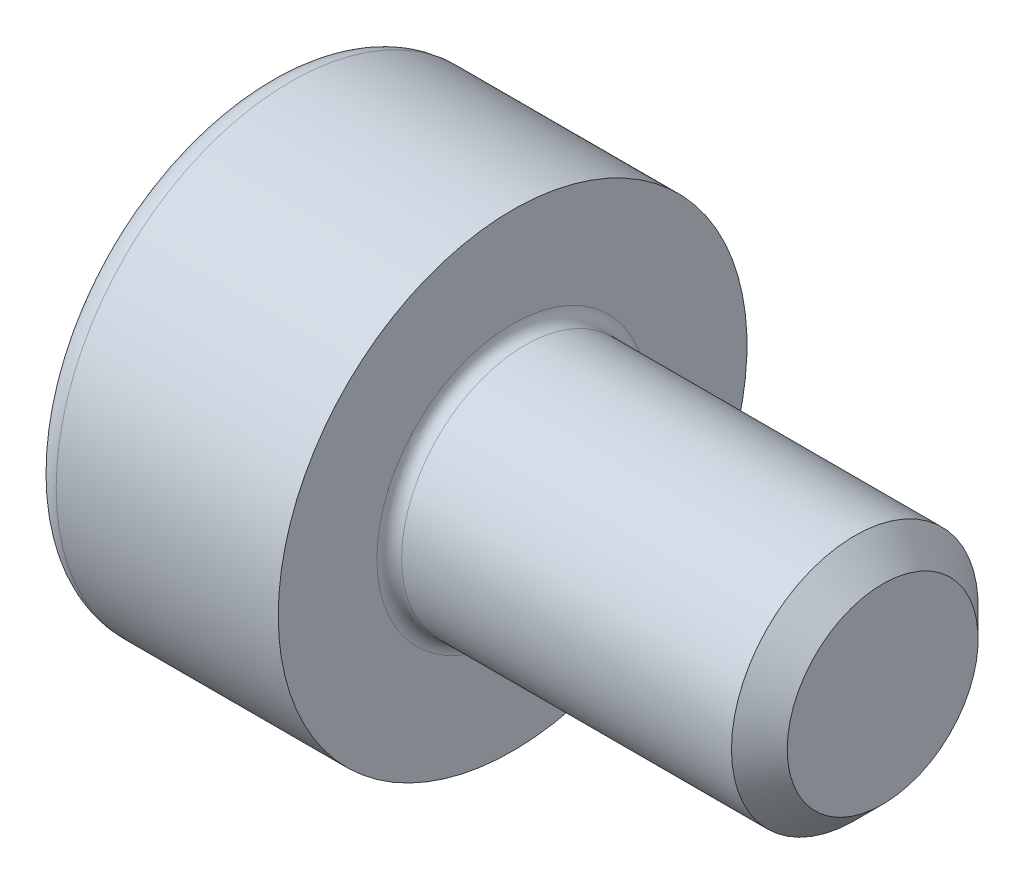
ISO-10303-21;
HEADER;
FILE_DESCRIPTION(('STEP AP214'),'2;1');
FILE_NAME('part.step','',(''),(''),'','','');
FILE_SCHEMA(('AUTOMOTIVE_DESIGN { 1 0 10303 214 1 1 1 1 }'));
ENDSEC;
DATA;
#1=APPLICATION_CONTEXT('core data for automotive mechanical design processes');
#2=APPLICATION_PROTOCOL_DEFINITION('international standard','automotive_design',2000,#1);
#3=PRODUCT_CONTEXT('',#1,'mechanical');
#4=PRODUCT('Part','Part','',(#3));
#5=PRODUCT_RELATED_PRODUCT_CATEGORY('part','',(#4));
#6=PRODUCT_DEFINITION_FORMATION('','',#4);
#7=PRODUCT_DEFINITION_CONTEXT('part definition',#1,'design');
#8=PRODUCT_DEFINITION('design','',#6,#7);
#9=PRODUCT_DEFINITION_SHAPE('','',#8);
#10=(LENGTH_UNIT() NAMED_UNIT(*) SI_UNIT(.MILLI.,.METRE.));
#11=(NAMED_UNIT(*) PLANE_ANGLE_UNIT() SI_UNIT($,.RADIAN.));
#12=(NAMED_UNIT(*) SI_UNIT($,.STERADIAN.) SOLID_ANGLE_UNIT());
#13=UNCERTAINTY_MEASURE_WITH_UNIT(LENGTH_MEASURE(1.E-05),#10,'distance_accuracy_value','');
#14=(GEOMETRIC_REPRESENTATION_CONTEXT(3) GLOBAL_UNCERTAINTY_ASSIGNED_CONTEXT((#13)) GLOBAL_UNIT_ASSIGNED_CONTEXT((#10,
#11,#12)) REPRESENTATION_CONTEXT('',''));
#15=CARTESIAN_POINT('',(0.,0.,0.));
#16=DIRECTION('',(0.,0.,1.));
#17=DIRECTION('',(1.,0.,0.));
#18=AXIS2_PLACEMENT_3D('',#15,#16,#17);
#19=CARTESIAN_POINT('',(5.,0.774,0.));
#20=DIRECTION('',(1.,0.,0.));
#21=DIRECTION('',(0.,0.,-1.));
#22=AXIS2_PLACEMENT_3D('',#19,#20,#21);
#23=PLANE('',#22);
#24=CARTESIAN_POINT('',(4.99999999993861,0.,0.));
#25=DIRECTION('',(-1.,0.,0.));
#26=DIRECTION('',(0.,0.,1.));
#27=AXIS2_PLACEMENT_3D('',#24,#25,#26);
#28=CIRCLE('',#27,0.773999999978514);
#29=CARTESIAN_POINT('',(4.99999999993861,0.,0.773999999978514));
#30=VERTEX_POINT('',#29);
#31=EDGE_CURVE('E108',#30,#30,#28,.T.);
#32=ORIENTED_EDGE('',*,*,#31,.F.);
#33=EDGE_LOOP('',(#32));
#34=FACE_BOUND('',#33,.T.);
#35=ADVANCED_FACE('F17',(#34),#23,.T.);
#36=CARTESIAN_POINT('',(0.999999999976353,0.,0.));
#37=DIRECTION('',(-1.,0.,0.));
#38=DIRECTION('',(0.,0.,1.));
#39=AXIS2_PLACEMENT_3D('',#36,#37,#38);
#40=CONICAL_SURFACE('',#39,0.760000000013861,1.04719755119142);
#41=CARTESIAN_POINT('',(1.43878620457372,0.,0.));
#42=VERTEX_POINT('',#41);
#43=VERTEX_LOOP('',#42);
#44=FACE_BOUND('',#43,.T.);
#45=CARTESIAN_POINT('',(0.999999999976353,0.,0.));
#46=DIRECTION('',(-1.,0.,0.));
#47=DIRECTION('',(0.,0.,1.));
#48=AXIS2_PLACEMENT_3D('',#45,#46,#47);
#49=CIRCLE('',#48,0.760000000013861);
#50=CARTESIAN_POINT('',(0.999999999988177,-0.658179306882177,0.380000000003467));
#51=VERTEX_POINT('',#50);
#52=CARTESIAN_POINT('',(0.999999999988177,0.,0.76000000000693));
#53=VERTEX_POINT('',#52);
#54=EDGE_CURVE('E97',#51,#53,#49,.T.);
#55=ORIENTED_EDGE('',*,*,#54,.T.);
#56=CARTESIAN_POINT('',(0.999999999976353,0.,0.));
#57=DIRECTION('',(-1.,0.,0.));
#58=DIRECTION('',(0.,0.,1.));
#59=AXIS2_PLACEMENT_3D('',#56,#57,#58);
#60=CIRCLE('',#59,0.760000000013861);
#61=CARTESIAN_POINT('',(0.999999999988177,0.658179306882173,0.380000000003464));
#62=VERTEX_POINT('',#61);
#63=EDGE_CURVE('E100',#53,#62,#60,.T.);
#64=ORIENTED_EDGE('',*,*,#63,.T.);
#65=CARTESIAN_POINT('',(0.999999999976353,0.,0.));
#66=DIRECTION('',(-1.,0.,0.));
#67=DIRECTION('',(0.,0.,1.));
#68=AXIS2_PLACEMENT_3D('',#65,#66,#67);
#69=CIRCLE('',#68,0.760000000013861);
#70=CARTESIAN_POINT('',(0.999999999988177,0.658179306882173,-0.380000000003465));
#71=VERTEX_POINT('',#70);
#72=EDGE_CURVE('E103',#62,#71,#69,.T.);
#73=ORIENTED_EDGE('',*,*,#72,.T.);
#74=CARTESIAN_POINT('',(0.999999999976353,0.,0.));
#75=DIRECTION('',(-1.,0.,0.));
#76=DIRECTION('',(0.,0.,1.));
#77=AXIS2_PLACEMENT_3D('',#74,#75,#76);
#78=CIRCLE('',#77,0.760000000013861);
#79=CARTESIAN_POINT('',(0.999999999988177,2.50354045686177E-13,-0.760000000006931));
#80=VERTEX_POINT('',#79);
#81=EDGE_CURVE('E118',#71,#80,#78,.T.);
#82=ORIENTED_EDGE('',*,*,#81,.T.);
#83=CARTESIAN_POINT('',(0.999999999976353,0.,0.));
#84=DIRECTION('',(-1.,0.,0.));
#85=DIRECTION('',(0.,0.,1.));
#86=AXIS2_PLACEMENT_3D('',#83,#84,#85);
#87=CIRCLE('',#86,0.760000000013861);
#88=CARTESIAN_POINT('',(0.999999999988177,-0.658179306882178,-0.380000000003466));
#89=VERTEX_POINT('',#88);
#90=EDGE_CURVE('E119',#80,#89,#87,.T.);
#91=ORIENTED_EDGE('',*,*,#90,.T.);
#92=CARTESIAN_POINT('',(0.999999999976353,0.,0.));
#93=DIRECTION('',(-1.,0.,0.));
#94=DIRECTION('',(0.,0.,1.));
#95=AXIS2_PLACEMENT_3D('',#92,#93,#94);
#96=CIRCLE('',#95,0.760000000013861);
#97=EDGE_CURVE('E226',#89,#51,#96,.T.);
#98=ORIENTED_EDGE('',*,*,#97,.T.);
#99=EDGE_LOOP('',(#55,#64,#73,#82,#91,#98));
#100=FACE_BOUND('',#99,.T.);
#101=ADVANCED_FACE('F102',(#44,#100),#40,.F.);
#102=CARTESIAN_POINT('',(4.77399999994077,0.,0.));
#103=DIRECTION('',(-1.,0.,0.));
#104=DIRECTION('',(0.,0.,1.));
#105=AXIS2_PLACEMENT_3D('',#102,#103,#104);
#106=CONICAL_SURFACE('',#105,0.999999999976353,0.785398163397448);
#107=CARTESIAN_POINT('',(4.774,0.,0.));
#108=DIRECTION('',(-1.,0.,0.));
#109=DIRECTION('',(0.,0.,1.));
#110=AXIS2_PLACEMENT_3D('',#107,#108,#109);
#111=CIRCLE('',#110,1.);
#112=CARTESIAN_POINT('',(4.774,0.,1.));
#113=VERTEX_POINT('',#112);
#114=EDGE_CURVE('E133',#113,#113,#111,.T.);
#115=ORIENTED_EDGE('',*,*,#114,.F.);
#116=EDGE_LOOP('',(#115));
#117=FACE_BOUND('',#116,.T.);
#118=ORIENTED_EDGE('',*,*,#31,.T.);
#119=EDGE_LOOP('',(#118));
#120=FACE_BOUND('',#119,.T.);
#121=ADVANCED_FACE('F516',(#117,#120),#106,.T.);
#122=CARTESIAN_POINT('',(1.,0.877572409168226,0.));
#123=DIRECTION('',(1.,0.,0.));
#124=DIRECTION('',(0.,0.,-1.));
#125=AXIS2_PLACEMENT_3D('',#122,#123,#124);
#126=PLANE('',#125);
#127=DIRECTION('',(0.,0.5,-0.866025403784439));
#128=VECTOR('',#127,1.);
#129=CARTESIAN_POINT('',(1.,0.877572409168226,0.));
#130=LINE('',#129,#128);
#131=CARTESIAN_POINT('',(1.,0.43878620458411,0.759999999999999));
#132=VERTEX_POINT('',#131);
#133=EDGE_CURVE('E122',#62,#132,#130,.F.);
#134=ORIENTED_EDGE('',*,*,#133,.F.);
#135=ORIENTED_EDGE('',*,*,#63,.F.);
#136=DIRECTION('',(0.,-1.,0.));
#137=VECTOR('',#136,1.);
#138=CARTESIAN_POINT('',(1.,-0.438786204584121,0.76));
#139=LINE('',#138,#137);
#140=EDGE_CURVE('E124',#53,#132,#139,.F.);
#141=ORIENTED_EDGE('',*,*,#140,.T.);
#142=EDGE_LOOP('',(#134,#135,#141));
#143=FACE_BOUND('',#142,.T.);
#144=ADVANCED_FACE('F123',(#143),#126,.F.);
#145=CARTESIAN_POINT('',(1.,0.877572409168226,0.));
#146=DIRECTION('',(1.,0.,0.));
#147=DIRECTION('',(0.,0.,-1.));
#148=AXIS2_PLACEMENT_3D('',#145,#146,#147);
#149=PLANE('',#148);
#150=DIRECTION('',(0.,-1.,0.));
#151=VECTOR('',#150,1.);
#152=CARTESIAN_POINT('',(1.,-0.438786204584121,0.76));
#153=LINE('',#152,#151);
#154=CARTESIAN_POINT('',(1.,-0.438786204584121,0.76));
#155=VERTEX_POINT('',#154);
#156=EDGE_CURVE('E128',#155,#53,#153,.F.);
#157=ORIENTED_EDGE('',*,*,#156,.T.);
#158=ORIENTED_EDGE('',*,*,#54,.F.);
#159=DIRECTION('',(0.,0.500000000000001,0.866025403784438));
#160=VECTOR('',#159,1.);
#161=CARTESIAN_POINT('',(1.,-0.438786204584121,0.76));
#162=LINE('',#161,#160);
#163=EDGE_CURVE('E183',#155,#51,#162,.F.);
#164=ORIENTED_EDGE('',*,*,#163,.F.);
#165=EDGE_LOOP('',(#157,#158,#164));
#166=FACE_BOUND('',#165,.T.);
#167=ADVANCED_FACE('F372',(#166),#149,.F.);
#168=CARTESIAN_POINT('',(1.,0.877572409168226,0.));
#169=DIRECTION('',(1.,0.,0.));
#170=DIRECTION('',(0.,0.,-1.));
#171=AXIS2_PLACEMENT_3D('',#168,#169,#170);
#172=PLANE('',#171);
#173=DIRECTION('',(0.,0.500000000000001,0.866025403784438));
#174=VECTOR('',#173,1.);
#175=CARTESIAN_POINT('',(1.,-0.438786204584121,0.76));
#176=LINE('',#175,#174);
#177=CARTESIAN_POINT('',(1.,-0.877572409168238,0.));
#178=VERTEX_POINT('',#177);
#179=EDGE_CURVE('E179',#51,#178,#176,.F.);
#180=ORIENTED_EDGE('',*,*,#179,.F.);
#181=ORIENTED_EDGE('',*,*,#97,.F.);
#182=DIRECTION('',(0.,-0.5,0.866025403784439));
#183=VECTOR('',#182,1.);
#184=CARTESIAN_POINT('',(1.,-0.877572409168238,0.));
#185=LINE('',#184,#183);
#186=EDGE_CURVE('E165',#178,#89,#185,.F.);
#187=ORIENTED_EDGE('',*,*,#186,.F.);
#188=EDGE_LOOP('',(#180,#181,#187));
#189=FACE_BOUND('',#188,.T.);
#190=ADVANCED_FACE('F367',(#189),#172,.F.);
#191=CARTESIAN_POINT('',(1.,0.877572409168226,0.));
#192=DIRECTION('',(1.,0.,0.));
#193=DIRECTION('',(0.,0.,-1.));
#194=AXIS2_PLACEMENT_3D('',#191,#192,#193);
#195=PLANE('',#194);
#196=DIRECTION('',(0.,-0.5,0.866025403784439));
#197=VECTOR('',#196,1.);
#198=CARTESIAN_POINT('',(1.,-0.877572409168238,0.));
#199=LINE('',#198,#197);
#200=CARTESIAN_POINT('',(1.,-0.438786204584122,-0.76));
#201=VERTEX_POINT('',#200);
#202=EDGE_CURVE('E162',#89,#201,#199,.F.);
#203=ORIENTED_EDGE('',*,*,#202,.F.);
#204=ORIENTED_EDGE('',*,*,#90,.F.);
#205=DIRECTION('',(0.,1.,0.));
#206=VECTOR('',#205,1.);
#207=CARTESIAN_POINT('',(1.,0.438786204584109,-0.760000000000001));
#208=LINE('',#207,#206);
#209=EDGE_CURVE('E156',#80,#201,#208,.F.);
#210=ORIENTED_EDGE('',*,*,#209,.T.);
#211=EDGE_LOOP('',(#203,#204,#210));
#212=FACE_BOUND('',#211,.T.);
#213=ADVANCED_FACE('F362',(#212),#195,.F.);
#214=CARTESIAN_POINT('',(1.,0.877572409168226,0.));
#215=DIRECTION('',(1.,0.,0.));
#216=DIRECTION('',(0.,0.,-1.));
#217=AXIS2_PLACEMENT_3D('',#214,#215,#216);
#218=PLANE('',#217);
#219=DIRECTION('',(0.,0.500000000000001,0.866025403784438));
#220=VECTOR('',#219,1.);
#221=CARTESIAN_POINT('',(1.,0.877572409168226,0.));
#222=LINE('',#221,#220);
#223=CARTESIAN_POINT('',(1.,0.877572409168226,0.));
#224=VERTEX_POINT('',#223);
#225=EDGE_CURVE('E116',#224,#71,#222,.F.);
#226=ORIENTED_EDGE('',*,*,#225,.T.);
#227=ORIENTED_EDGE('',*,*,#72,.F.);
#228=DIRECTION('',(0.,0.5,-0.866025403784439));
#229=VECTOR('',#228,1.);
#230=CARTESIAN_POINT('',(1.,0.877572409168226,0.));
#231=LINE('',#230,#229);
#232=EDGE_CURVE('E113',#224,#62,#231,.F.);
#233=ORIENTED_EDGE('',*,*,#232,.F.);
#234=EDGE_LOOP('',(#226,#227,#233));
#235=FACE_BOUND('',#234,.T.);
#236=ADVANCED_FACE('F111',(#235),#218,.F.);
#237=CARTESIAN_POINT('',(1.,0.877572409168226,0.));
#238=DIRECTION('',(1.,0.,0.));
#239=DIRECTION('',(0.,0.,-1.));
#240=AXIS2_PLACEMENT_3D('',#237,#238,#239);
#241=PLANE('',#240);
#242=DIRECTION('',(0.,1.,0.));
#243=VECTOR('',#242,1.);
#244=CARTESIAN_POINT('',(1.,0.438786204584109,-0.760000000000001));
#245=LINE('',#244,#243);
#246=CARTESIAN_POINT('',(1.,0.438786204584109,-0.760000000000001));
#247=VERTEX_POINT('',#246);
#248=EDGE_CURVE('E159',#247,#80,#245,.F.);
#249=ORIENTED_EDGE('',*,*,#248,.T.);
#250=ORIENTED_EDGE('',*,*,#81,.F.);
#251=DIRECTION('',(0.,0.500000000000001,0.866025403784438));
#252=VECTOR('',#251,1.);
#253=CARTESIAN_POINT('',(1.,0.877572409168226,0.));
#254=LINE('',#253,#252);
#255=EDGE_CURVE('E328',#71,#247,#254,.F.);
#256=ORIENTED_EDGE('',*,*,#255,.T.);
#257=EDGE_LOOP('',(#249,#250,#256));
#258=FACE_BOUND('',#257,.T.);
#259=ADVANCED_FACE('F471',(#258),#241,.F.);
#260=CARTESIAN_POINT('',(-31.75,0.,0.));
#261=DIRECTION('',(-1.,0.,0.));
#262=DIRECTION('',(0.,0.,1.));
#263=AXIS2_PLACEMENT_3D('',#260,#261,#262);
#264=CYLINDRICAL_SURFACE('',#263,1.);
#265=CARTESIAN_POINT('',(2.1,0.,0.));
#266=DIRECTION('',(1.,0.,0.));
#267=DIRECTION('',(0.,0.,-1.));
#268=AXIS2_PLACEMENT_3D('',#265,#266,#267);
#269=CIRCLE('',#268,1.);
#270=CARTESIAN_POINT('',(2.1,0.,-1.));
#271=VERTEX_POINT('',#270);
#272=EDGE_CURVE('E147',#271,#271,#269,.T.);
#273=ORIENTED_EDGE('',*,*,#272,.T.);
#274=EDGE_LOOP('',(#273));
#275=FACE_BOUND('',#274,.T.);
#276=ORIENTED_EDGE('',*,*,#114,.T.);
#277=EDGE_LOOP('',(#276));
#278=FACE_BOUND('',#277,.T.);
#279=ADVANCED_FACE('F384',(#275,#278),#264,.T.);
#280=CARTESIAN_POINT('',(1.,0.877572409168226,0.));
#281=DIRECTION('',(0.,-0.866025403784439,-0.5));
#282=DIRECTION('',(0.,0.5,-0.866025403784439));
#283=AXIS2_PLACEMENT_3D('',#280,#281,#282);
#284=PLANE('',#283);
#285=ORIENTED_EDGE('',*,*,#133,.T.);
#286=DIRECTION('',(1.,0.,0.));
#287=VECTOR('',#286,1.);
#288=CARTESIAN_POINT('',(1.,0.43878620458411,0.759999999999999));
#289=LINE('',#288,#287);
#290=CARTESIAN_POINT('',(0.,0.43878620458411,0.759999999999999));
#291=VERTEX_POINT('',#290);
#292=EDGE_CURVE('E203',#132,#291,#289,.F.);
#293=ORIENTED_EDGE('',*,*,#292,.T.);
#294=DIRECTION('',(0.,-0.5,0.866025403784439));
#295=VECTOR('',#294,1.);
#296=CARTESIAN_POINT('',(0.,0.877572409168226,0.));
#297=LINE('',#296,#295);
#298=CARTESIAN_POINT('',(0.,0.877572409168226,0.));
#299=VERTEX_POINT('',#298);
#300=EDGE_CURVE('E143',#299,#291,#297,.T.);
#301=ORIENTED_EDGE('',*,*,#300,.F.);
#302=DIRECTION('',(1.,0.,0.));
#303=VECTOR('',#302,1.);
#304=CARTESIAN_POINT('',(1.,0.877572409168226,0.));
#305=LINE('',#304,#303);
#306=EDGE_CURVE('E132',#299,#224,#305,.T.);
#307=ORIENTED_EDGE('',*,*,#306,.T.);
#308=ORIENTED_EDGE('',*,*,#232,.T.);
#309=EDGE_LOOP('',(#285,#293,#301,#307,#308));
#310=FACE_BOUND('',#309,.T.);
#311=ADVANCED_FACE('F130',(#310),#284,.T.);
#312=CARTESIAN_POINT('',(1.,-0.438786204584121,0.76));
#313=DIRECTION('',(0.,0.,1.));
#314=DIRECTION('',(0.,-1.,0.));
#315=AXIS2_PLACEMENT_3D('',#312,#313,#314);
#316=PLANE('',#315);
#317=ORIENTED_EDGE('',*,*,#292,.F.);
#318=ORIENTED_EDGE('',*,*,#140,.F.);
#319=ORIENTED_EDGE('',*,*,#156,.F.);
#320=DIRECTION('',(1.,0.,0.));
#321=VECTOR('',#320,1.);
#322=CARTESIAN_POINT('',(1.,-0.438786204584121,0.76));
#323=LINE('',#322,#321);
#324=CARTESIAN_POINT('',(0.,-0.438786204584121,0.76));
#325=VERTEX_POINT('',#324);
#326=EDGE_CURVE('E198',#325,#155,#323,.T.);
#327=ORIENTED_EDGE('',*,*,#326,.F.);
#328=DIRECTION('',(0.,1.,0.));
#329=VECTOR('',#328,1.);
#330=CARTESIAN_POINT('',(0.,0.,0.759999999999999));
#331=LINE('',#330,#329);
#332=EDGE_CURVE('E146',#291,#325,#331,.F.);
#333=ORIENTED_EDGE('',*,*,#332,.F.);
#334=EDGE_LOOP('',(#317,#318,#319,#327,#333));
#335=FACE_BOUND('',#334,.T.);
#336=ADVANCED_FACE('F374',(#335),#316,.F.);
#337=CARTESIAN_POINT('',(1.,-0.438786204584121,0.76));
#338=DIRECTION('',(0.,0.866025403784438,-0.500000000000001));
#339=DIRECTION('',(0.,0.500000000000001,0.866025403784438));
#340=AXIS2_PLACEMENT_3D('',#337,#338,#339);
#341=PLANE('',#340);
#342=ORIENTED_EDGE('',*,*,#179,.T.);
#343=DIRECTION('',(1.,0.,0.));
#344=VECTOR('',#343,1.);
#345=CARTESIAN_POINT('',(1.,-0.877572409168238,0.));
#346=LINE('',#345,#344);
#347=CARTESIAN_POINT('',(0.,-0.877572409168238,0.));
#348=VERTEX_POINT('',#347);
#349=EDGE_CURVE('E174',#348,#178,#346,.T.);
#350=ORIENTED_EDGE('',*,*,#349,.F.);
#351=DIRECTION('',(0.,-0.500000000000001,-0.866025403784438));
#352=VECTOR('',#351,1.);
#353=CARTESIAN_POINT('',(0.,-0.438786204584121,0.76));
#354=LINE('',#353,#352);
#355=EDGE_CURVE('E189',#325,#348,#354,.T.);
#356=ORIENTED_EDGE('',*,*,#355,.F.);
#357=ORIENTED_EDGE('',*,*,#326,.T.);
#358=ORIENTED_EDGE('',*,*,#163,.T.);
#359=EDGE_LOOP('',(#342,#350,#356,#357,#358));
#360=FACE_BOUND('',#359,.T.);
#361=ADVANCED_FACE('F370',(#360),#341,.T.);
#362=CARTESIAN_POINT('',(1.,-0.877572409168238,0.));
#363=DIRECTION('',(0.,0.866025403784439,0.5));
#364=DIRECTION('',(0.,-0.5,0.866025403784439));
#365=AXIS2_PLACEMENT_3D('',#362,#363,#364);
#366=PLANE('',#365);
#367=ORIENTED_EDGE('',*,*,#202,.T.);
#368=DIRECTION('',(1.,0.,0.));
#369=VECTOR('',#368,1.);
#370=CARTESIAN_POINT('',(1.,-0.438786204584122,-0.76));
#371=LINE('',#370,#369);
#372=CARTESIAN_POINT('',(0.,-0.438786204584122,-0.76));
#373=VERTEX_POINT('',#372);
#374=EDGE_CURVE('E158',#201,#373,#371,.F.);
#375=ORIENTED_EDGE('',*,*,#374,.T.);
#376=DIRECTION('',(0.,0.5,-0.866025403784439));
#377=VECTOR('',#376,1.);
#378=CARTESIAN_POINT('',(0.,-0.877572409168238,0.));
#379=LINE('',#378,#377);
#380=EDGE_CURVE('E186',#348,#373,#379,.T.);
#381=ORIENTED_EDGE('',*,*,#380,.F.);
#382=ORIENTED_EDGE('',*,*,#349,.T.);
#383=ORIENTED_EDGE('',*,*,#186,.T.);
#384=EDGE_LOOP('',(#367,#375,#381,#382,#383));
#385=FACE_BOUND('',#384,.T.);
#386=ADVANCED_FACE('F358',(#385),#366,.T.);
#387=CARTESIAN_POINT('',(1.,0.438786204584109,-0.760000000000001));
#388=DIRECTION('',(0.,0.,-1.));
#389=DIRECTION('',(0.,1.,0.));
#390=AXIS2_PLACEMENT_3D('',#387,#388,#389);
#391=PLANE('',#390);
#392=ORIENTED_EDGE('',*,*,#374,.F.);
#393=ORIENTED_EDGE('',*,*,#209,.F.);
#394=ORIENTED_EDGE('',*,*,#248,.F.);
#395=DIRECTION('',(1.,0.,0.));
#396=VECTOR('',#395,1.);
#397=CARTESIAN_POINT('',(1.,0.438786204584109,-0.760000000000001));
#398=LINE('',#397,#396);
#399=CARTESIAN_POINT('',(0.,0.438786204584109,-0.760000000000001));
#400=VERTEX_POINT('',#399);
#401=EDGE_CURVE('E326',#247,#400,#398,.F.);
#402=ORIENTED_EDGE('',*,*,#401,.T.);
#403=DIRECTION('',(0.,1.,0.));
#404=VECTOR('',#403,1.);
#405=CARTESIAN_POINT('',(0.,0.,-0.76));
#406=LINE('',#405,#404);
#407=EDGE_CURVE('E153',#373,#400,#406,.T.);
#408=ORIENTED_EDGE('',*,*,#407,.F.);
#409=EDGE_LOOP('',(#392,#393,#394,#402,#408));
#410=FACE_BOUND('',#409,.T.);
#411=ADVANCED_FACE('F347',(#410),#391,.F.);
#412=CARTESIAN_POINT('',(1.,0.877572409168226,0.));
#413=DIRECTION('',(0.,0.866025403784438,-0.500000000000001));
#414=DIRECTION('',(0.,0.500000000000001,0.866025403784438));
#415=AXIS2_PLACEMENT_3D('',#412,#413,#414);
#416=PLANE('',#415);
#417=ORIENTED_EDGE('',*,*,#401,.F.);
#418=ORIENTED_EDGE('',*,*,#255,.F.);
#419=ORIENTED_EDGE('',*,*,#225,.F.);
#420=ORIENTED_EDGE('',*,*,#306,.F.);
#421=DIRECTION('',(0.,0.500000000000001,0.866025403784438));
#422=VECTOR('',#421,1.);
#423=CARTESIAN_POINT('',(0.,0.438786204584109,-0.760000000000001));
#424=LINE('',#423,#422);
#425=EDGE_CURVE('E150',#400,#299,#424,.T.);
#426=ORIENTED_EDGE('',*,*,#425,.F.);
#427=EDGE_LOOP('',(#417,#418,#419,#420,#426));
#428=FACE_BOUND('',#427,.T.);
#429=ADVANCED_FACE('F352',(#428),#416,.F.);
#430=CARTESIAN_POINT('',(2.1,0.,0.));
#431=DIRECTION('',(1.,0.,0.));
#432=DIRECTION('',(0.,0.,-1.));
#433=AXIS2_PLACEMENT_3D('',#430,#431,#432);
#434=TOROIDAL_SURFACE('',#433,1.1,0.1);
#435=ORIENTED_EDGE('',*,*,#272,.F.);
#436=EDGE_LOOP('',(#435));
#437=FACE_BOUND('',#436,.T.);
#438=CARTESIAN_POINT('',(2.,0.,0.));
#439=DIRECTION('',(1.,0.,0.));
#440=DIRECTION('',(0.,0.,1.));
#441=AXIS2_PLACEMENT_3D('',#438,#439,#440);
#442=CIRCLE('',#441,1.1);
#443=CARTESIAN_POINT('',(2.,0.,-1.1));
#444=VERTEX_POINT('',#443);
#445=CARTESIAN_POINT('',(2.,0.,1.1));
#446=VERTEX_POINT('',#445);
#447=EDGE_CURVE('E259',#444,#446,#442,.F.);
#448=ORIENTED_EDGE('',*,*,#447,.F.);
#449=CARTESIAN_POINT('',(2.,0.,0.));
#450=DIRECTION('',(1.,0.,0.));
#451=DIRECTION('',(0.,0.,-1.));
#452=AXIS2_PLACEMENT_3D('',#449,#450,#451);
#453=CIRCLE('',#452,1.1);
#454=EDGE_CURVE('E269',#446,#444,#453,.F.);
#455=ORIENTED_EDGE('',*,*,#454,.F.);
#456=EDGE_LOOP('',(#448,#455));
#457=FACE_BOUND('',#456,.T.);
#458=ADVANCED_FACE('F290',(#437,#457),#434,.F.);
#459=CARTESIAN_POINT('',(0.,0.,0.));
#460=DIRECTION('',(-1.,0.,0.));
#461=DIRECTION('',(0.,0.,1.));
#462=AXIS2_PLACEMENT_3D('',#459,#460,#461);
#463=PLANE('',#462);
#464=CARTESIAN_POINT('',(0.,0.,0.));
#465=DIRECTION('',(1.,0.,0.));
#466=DIRECTION('',(0.,0.,-1.));
#467=AXIS2_PLACEMENT_3D('',#464,#465,#466);
#468=CIRCLE('',#467,1.7);
#469=CARTESIAN_POINT('',(0.,0.,-1.7));
#470=VERTEX_POINT('',#469);
#471=CARTESIAN_POINT('',(0.,0.,1.7));
#472=VERTEX_POINT('',#471);
#473=EDGE_CURVE('E223',#470,#472,#468,.T.);
#474=ORIENTED_EDGE('',*,*,#473,.F.);
#475=CARTESIAN_POINT('',(0.,0.,0.));
#476=DIRECTION('',(1.,0.,0.));
#477=DIRECTION('',(0.,0.,1.));
#478=AXIS2_PLACEMENT_3D('',#475,#476,#477);
#479=CIRCLE('',#478,1.7);
#480=EDGE_CURVE('E36',#472,#470,#479,.T.);
#481=ORIENTED_EDGE('',*,*,#480,.F.);
#482=EDGE_LOOP('',(#474,#481));
#483=FACE_BOUND('',#482,.T.);
#484=ORIENTED_EDGE('',*,*,#407,.T.);
#485=ORIENTED_EDGE('',*,*,#425,.T.);
#486=ORIENTED_EDGE('',*,*,#300,.T.);
#487=ORIENTED_EDGE('',*,*,#332,.T.);
#488=ORIENTED_EDGE('',*,*,#355,.T.);
#489=ORIENTED_EDGE('',*,*,#380,.T.);
#490=EDGE_LOOP('',(#484,#485,#486,#487,#488,#489));
#491=FACE_BOUND('',#490,.T.);
#492=ADVANCED_FACE('F282',(#483,#491),#463,.T.);
#493=CARTESIAN_POINT('',(2.,1.9,0.));
#494=DIRECTION('',(1.,0.,0.));
#495=DIRECTION('',(0.,0.,-1.));
#496=AXIS2_PLACEMENT_3D('',#493,#494,#495);
#497=PLANE('',#496);
#498=CARTESIAN_POINT('',(2.,0.,0.));
#499=DIRECTION('',(-1.,0.,0.));
#500=DIRECTION('',(0.,0.,1.));
#501=AXIS2_PLACEMENT_3D('',#498,#499,#500);
#502=CIRCLE('',#501,1.9);
#503=CARTESIAN_POINT('',(2.,0.,1.9));
#504=VERTEX_POINT('',#503);
#505=EDGE_CURVE('E28',#504,#504,#502,.T.);
#506=ORIENTED_EDGE('',*,*,#505,.F.);
#507=EDGE_LOOP('',(#506));
#508=FACE_BOUND('',#507,.T.);
#509=ORIENTED_EDGE('',*,*,#447,.T.);
#510=ORIENTED_EDGE('',*,*,#454,.T.);
#511=EDGE_LOOP('',(#509,#510));
#512=FACE_BOUND('',#511,.T.);
#513=ADVANCED_FACE('F248',(#508,#512),#497,.T.);
#514=CARTESIAN_POINT('',(0.199999999999999,0.,0.));
#515=DIRECTION('',(-1.,0.,0.));
#516=DIRECTION('',(0.,0.,1.));
#517=AXIS2_PLACEMENT_3D('',#514,#515,#516);
#518=TOROIDAL_SURFACE('',#517,1.7,0.2);
#519=ORIENTED_EDGE('',*,*,#480,.T.);
#520=ORIENTED_EDGE('',*,*,#473,.T.);
#521=EDGE_LOOP('',(#519,#520));
#522=FACE_BOUND('',#521,.T.);
#523=CARTESIAN_POINT('',(0.199999999999999,0.,0.));
#524=DIRECTION('',(-1.,0.,0.));
#525=DIRECTION('',(0.,0.,1.));
#526=AXIS2_PLACEMENT_3D('',#523,#524,#525);
#527=CIRCLE('',#526,1.9);
#528=CARTESIAN_POINT('',(0.199999999999999,0.,1.9));
#529=VERTEX_POINT('',#528);
#530=EDGE_CURVE('E11',#529,#529,#527,.F.);
#531=ORIENTED_EDGE('',*,*,#530,.F.);
#532=EDGE_LOOP('',(#531));
#533=FACE_BOUND('',#532,.T.);
#534=ADVANCED_FACE('F236',(#522,#533),#518,.T.);
#535=CARTESIAN_POINT('',(-31.75,0.,0.));
#536=DIRECTION('',(-1.,0.,0.));
#537=DIRECTION('',(0.,0.,1.));
#538=AXIS2_PLACEMENT_3D('',#535,#536,#537);
#539=CYLINDRICAL_SURFACE('',#538,1.9);
#540=ORIENTED_EDGE('',*,*,#530,.T.);
#541=EDGE_LOOP('',(#540));
#542=FACE_BOUND('',#541,.T.);
#543=ORIENTED_EDGE('',*,*,#505,.T.);
#544=EDGE_LOOP('',(#543));
#545=FACE_BOUND('',#544,.T.);
#546=ADVANCED_FACE('F247',(#542,#545),#539,.T.);
#547=CLOSED_SHELL('',(#35,#101,#121,#144,#167,#190,#213,#236,#259,#279,#311,#336,#361,#386,#411,
#429,#458,#492,#513,#534,#546));
#548=MANIFOLD_SOLID_BREP('B1',#547);
#549=ADVANCED_BREP_SHAPE_REPRESENTATION('',(#18,#548),#14);
#550=SHAPE_DEFINITION_REPRESENTATION(#9,#549);
ENDSEC;
END-ISO-10303-21;
